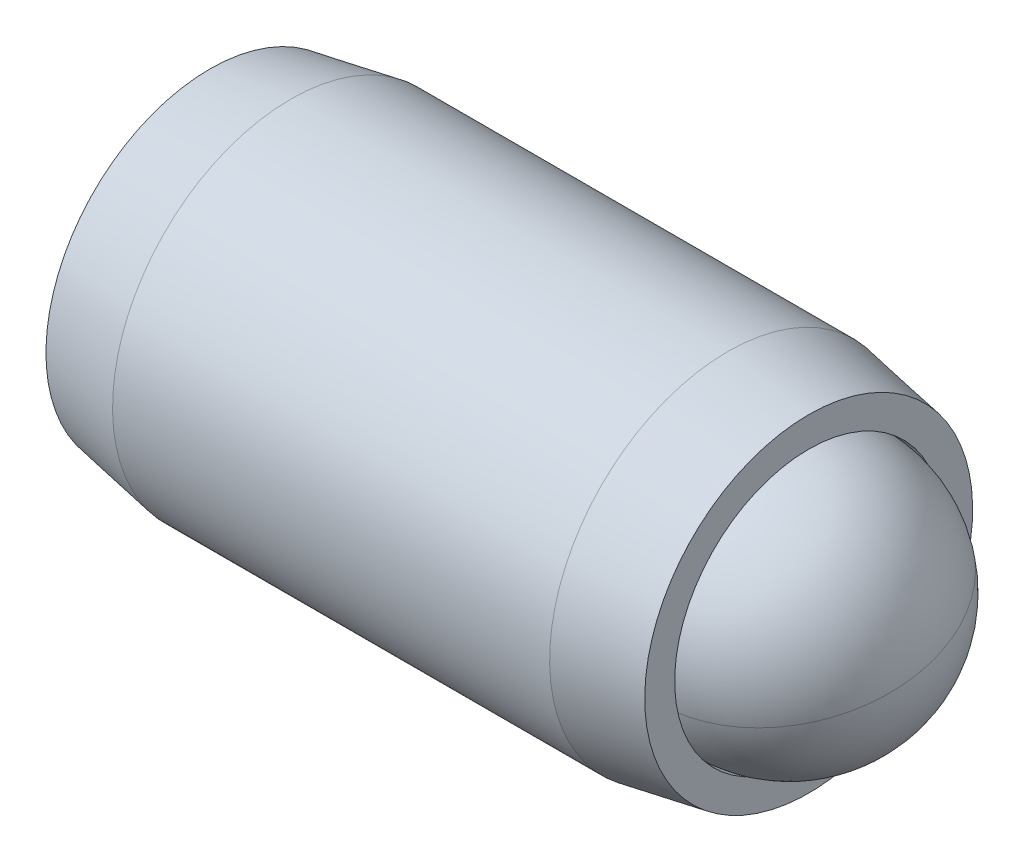
ISO-10303-21;
HEADER;
FILE_DESCRIPTION(('STEP AP214'),'2;1');
FILE_NAME('part.step','',(''),(''),'','','');
FILE_SCHEMA(('AUTOMOTIVE_DESIGN { 1 0 10303 214 1 1 1 1 }'));
ENDSEC;
DATA;
#1=APPLICATION_CONTEXT('core data for automotive mechanical design processes');
#2=APPLICATION_PROTOCOL_DEFINITION('international standard','automotive_design',2000,#1);
#3=PRODUCT_CONTEXT('',#1,'mechanical');
#4=PRODUCT('Part','Part','',(#3));
#5=PRODUCT_RELATED_PRODUCT_CATEGORY('part','',(#4));
#6=PRODUCT_DEFINITION_FORMATION('','',#4);
#7=PRODUCT_DEFINITION_CONTEXT('part definition',#1,'design');
#8=PRODUCT_DEFINITION('design','',#6,#7);
#9=PRODUCT_DEFINITION_SHAPE('','',#8);
#10=(LENGTH_UNIT() NAMED_UNIT(*) SI_UNIT(.MILLI.,.METRE.));
#11=(NAMED_UNIT(*) PLANE_ANGLE_UNIT() SI_UNIT($,.RADIAN.));
#12=(NAMED_UNIT(*) SI_UNIT($,.STERADIAN.) SOLID_ANGLE_UNIT());
#13=UNCERTAINTY_MEASURE_WITH_UNIT(LENGTH_MEASURE(1.E-05),#10,'distance_accuracy_value','');
#14=(GEOMETRIC_REPRESENTATION_CONTEXT(3) GLOBAL_UNCERTAINTY_ASSIGNED_CONTEXT((#13)) GLOBAL_UNIT_ASSIGNED_CONTEXT((#10,
#11,#12)) REPRESENTATION_CONTEXT('',''));
#15=CARTESIAN_POINT('',(0.,0.,0.));
#16=DIRECTION('',(0.,0.,1.));
#17=DIRECTION('',(1.,0.,0.));
#18=AXIS2_PLACEMENT_3D('',#15,#16,#17);
#19=CARTESIAN_POINT('',(-8.05134594701911,2.7420499882851,-0.965131231055238));
#20=DIRECTION('',(-1.,0.,0.));
#21=DIRECTION('',(0.,-1.,0.));
#22=AXIS2_PLACEMENT_3D('',#19,#20,#21);
#23=PLANE('',#22);
#24=DIRECTION('',(0.,0.866025403784439,-0.5));
#25=VECTOR('',#24,1.);
#26=CARTESIAN_POINT('',(-8.05134594701911,2.61504998828509,-2.33078112403965));
#27=LINE('',#26,#25);
#28=CARTESIAN_POINT('',(-8.05134594701911,1.49586248828509,-1.68461791964099));
#29=VERTEX_POINT('',#28);
#30=CARTESIAN_POINT('',(-8.05134594701911,2.74204998828509,-2.40410460822674));
#31=VERTEX_POINT('',#30);
#32=EDGE_CURVE('P0_E164',#29,#31,#27,.T.);
#33=ORIENTED_EDGE('',*,*,#32,.T.);
#34=DIRECTION('',(0.,0.866025403784439,0.5));
#35=VECTOR('',#34,1.);
#36=CARTESIAN_POINT('',(-8.05134594701911,3.8612374882851,-1.75794140382807));
#37=LINE('',#36,#35);
#38=CARTESIAN_POINT('',(-8.05134594701911,3.9882374882851,-1.68461791964099));
#39=VERTEX_POINT('',#38);
#40=EDGE_CURVE('P0_E166',#31,#39,#37,.T.);
#41=ORIENTED_EDGE('',*,*,#40,.T.);
#42=DIRECTION('',(0.,0.,1.));
#43=VECTOR('',#42,1.);
#44=CARTESIAN_POINT('',(-8.05134594701911,3.9882374882851,-0.392291510843657));
#45=LINE('',#44,#43);
#46=CARTESIAN_POINT('',(-8.05134594701911,3.9882374882851,-0.245644542469491));
#47=VERTEX_POINT('',#46);
#48=EDGE_CURVE('P0_E156',#39,#47,#45,.T.);
#49=ORIENTED_EDGE('',*,*,#48,.T.);
#50=DIRECTION('',(0.,-0.866025403784438,0.500000000000001));
#51=VECTOR('',#50,1.);
#52=CARTESIAN_POINT('',(-8.05134594701911,2.8690499882851,0.400518661929175));
#53=LINE('',#52,#51);
#54=CARTESIAN_POINT('',(-8.05134594701911,2.7420499882851,0.473842146116258));
#55=VERTEX_POINT('',#54);
#56=EDGE_CURVE('P0_E158',#47,#55,#53,.T.);
#57=ORIENTED_EDGE('',*,*,#56,.T.);
#58=DIRECTION('',(0.,-0.866025403784439,-0.5));
#59=VECTOR('',#58,1.);
#60=CARTESIAN_POINT('',(-8.05134594701911,1.62286248828509,-0.172321058282407));
#61=LINE('',#60,#59);
#62=CARTESIAN_POINT('',(-8.05134594701911,1.49586248828509,-0.24564454246949));
#63=VERTEX_POINT('',#62);
#64=EDGE_CURVE('P0_E160',#55,#63,#61,.T.);
#65=ORIENTED_EDGE('',*,*,#64,.T.);
#66=DIRECTION('',(0.,0.,-1.));
#67=VECTOR('',#66,1.);
#68=CARTESIAN_POINT('',(-8.05134594701911,1.49586248828509,-1.53797095126682));
#69=LINE('',#68,#67);
#70=EDGE_CURVE('P0_E162',#63,#29,#69,.T.);
#71=ORIENTED_EDGE('',*,*,#70,.T.);
#72=EDGE_LOOP('',(#33,#41,#49,#57,#65,#71));
#73=FACE_BOUND('',#72,.T.);
#74=CARTESIAN_POINT('',(-8.05134594701911,2.7420499882851,-0.965131231055238));
#75=DIRECTION('',(1.,0.,0.));
#76=DIRECTION('',(0.,1.,0.));
#77=AXIS2_PLACEMENT_3D('',#74,#75,#76);
#78=CIRCLE('',#77,2.921);
#79=CARTESIAN_POINT('',(-8.05134594701911,5.6630499882851,-0.965131231055238));
#80=VERTEX_POINT('',#79);
#81=EDGE_CURVE('P0_E150',#80,#80,#78,.T.);
#82=ORIENTED_EDGE('',*,*,#81,.F.);
#83=EDGE_LOOP('',(#82));
#84=FACE_BOUND('',#83,.T.);
#85=ADVANCED_FACE('P0_F17',(#73,#84),#23,.T.);
#86=CARTESIAN_POINT('',(-6.61084036483622,2.7420499882851,-0.965131231055238));
#87=DIRECTION('',(1.,0.,0.));
#88=DIRECTION('',(0.,1.,0.));
#89=AXIS2_PLACEMENT_3D('',#86,#87,#88);
#90=CONICAL_SURFACE('',#89,3.175,0.174532925199434);
#91=ORIENTED_EDGE('',*,*,#81,.T.);
#92=EDGE_LOOP('',(#91));
#93=FACE_BOUND('',#92,.T.);
#94=CARTESIAN_POINT('',(-6.61084036483622,2.7420499882851,-0.965131231055238));
#95=DIRECTION('',(1.,0.,0.));
#96=DIRECTION('',(0.,1.,0.));
#97=AXIS2_PLACEMENT_3D('',#94,#95,#96);
#98=CIRCLE('',#97,3.175);
#99=CARTESIAN_POINT('',(-6.61084036483622,5.9170499882851,-0.965131231055238));
#100=VERTEX_POINT('',#99);
#101=EDGE_CURVE('P0_E147',#100,#100,#98,.T.);
#102=ORIENTED_EDGE('',*,*,#101,.F.);
#103=EDGE_LOOP('',(#102));
#104=FACE_BOUND('',#103,.T.);
#105=ADVANCED_FACE('P0_F225',(#93,#104),#90,.T.);
#106=CARTESIAN_POINT('',(-1.10019199242004,2.7420499882851,-0.965131231055238));
#107=DIRECTION('',(1.,0.,0.));
#108=DIRECTION('',(0.,1.,0.));
#109=AXIS2_PLACEMENT_3D('',#106,#107,#108);
#110=CYLINDRICAL_SURFACE('',#109,3.175);
#111=ORIENTED_EDGE('',*,*,#101,.T.);
#112=EDGE_LOOP('',(#111));
#113=FACE_BOUND('',#112,.T.);
#114=CARTESIAN_POINT('',(1.176148470798,2.7420499882851,-0.965131231055238));
#115=DIRECTION('',(1.,0.,0.));
#116=DIRECTION('',(0.,1.,0.));
#117=AXIS2_PLACEMENT_3D('',#114,#115,#116);
#118=CIRCLE('',#117,3.175);
#119=CARTESIAN_POINT('',(1.176148470798,5.9170499882851,-0.965131231055238));
#120=VERTEX_POINT('',#119);
#121=EDGE_CURVE('P0_E144',#120,#120,#118,.T.);
#122=ORIENTED_EDGE('',*,*,#121,.F.);
#123=EDGE_LOOP('',(#122));
#124=FACE_BOUND('',#123,.T.);
#125=ADVANCED_FACE('P0_F231',(#113,#124),#110,.T.);
#126=CARTESIAN_POINT('',(2.61665405298089,2.7420499882851,-0.965131231055238));
#127=DIRECTION('',(-1.,0.,0.));
#128=DIRECTION('',(0.,-1.,0.));
#129=AXIS2_PLACEMENT_3D('',#126,#127,#128);
#130=CONICAL_SURFACE('',#129,2.921,0.174532925199434);
#131=ORIENTED_EDGE('',*,*,#121,.T.);
#132=EDGE_LOOP('',(#131));
#133=FACE_BOUND('',#132,.T.);
#134=CARTESIAN_POINT('',(2.61665405298089,2.7420499882851,-0.965131231055238));
#135=DIRECTION('',(1.,0.,0.));
#136=DIRECTION('',(0.,1.,0.));
#137=AXIS2_PLACEMENT_3D('',#134,#135,#136);
#138=CIRCLE('',#137,2.921);
#139=CARTESIAN_POINT('',(2.61665405298089,5.6630499882851,-0.965131231055238));
#140=VERTEX_POINT('',#139);
#141=EDGE_CURVE('P0_E141',#140,#140,#138,.T.);
#142=ORIENTED_EDGE('',*,*,#141,.F.);
#143=EDGE_LOOP('',(#142));
#144=FACE_BOUND('',#143,.T.);
#145=ADVANCED_FACE('P0_F275',(#133,#144),#130,.T.);
#146=CARTESIAN_POINT('',(2.61665405298089,5.6630499882851,-0.965131231055238));
#147=DIRECTION('',(1.,0.,0.));
#148=DIRECTION('',(0.,1.,0.));
#149=AXIS2_PLACEMENT_3D('',#146,#147,#148);
#150=PLANE('',#149);
#151=ORIENTED_EDGE('',*,*,#141,.T.);
#152=EDGE_LOOP('',(#151));
#153=FACE_BOUND('',#152,.T.);
#154=CARTESIAN_POINT('',(2.61665405298089,2.7420499882851,-0.965131231055238));
#155=DIRECTION('',(1.,0.,0.));
#156=DIRECTION('',(0.,1.,0.));
#157=AXIS2_PLACEMENT_3D('',#154,#155,#156);
#158=CIRCLE('',#157,2.3876);
#159=CARTESIAN_POINT('',(2.61665405298089,5.1296499882851,-0.965131231055238));
#160=VERTEX_POINT('',#159);
#161=EDGE_CURVE('P0_E138',#160,#160,#158,.T.);
#162=ORIENTED_EDGE('',*,*,#161,.F.);
#163=EDGE_LOOP('',(#162));
#164=FACE_BOUND('',#163,.T.);
#165=ADVANCED_FACE('P0_F271',(#153,#164),#150,.T.);
#166=CARTESIAN_POINT('',(-1.10019199242004,2.7420499882851,-0.965131231055238));
#167=DIRECTION('',(1.,0.,0.));
#168=DIRECTION('',(0.,1.,0.));
#169=AXIS2_PLACEMENT_3D('',#166,#167,#168);
#170=CYLINDRICAL_SURFACE('',#169,2.3876);
#171=ORIENTED_EDGE('',*,*,#161,.T.);
#172=EDGE_LOOP('',(#171));
#173=FACE_BOUND('',#172,.T.);
#174=CARTESIAN_POINT('',(1.28740800757995,2.7420499882851,-0.965131231055238));
#175=DIRECTION('',(1.,0.,0.));
#176=DIRECTION('',(0.,1.,0.));
#177=AXIS2_PLACEMENT_3D('',#174,#175,#176);
#178=CIRCLE('',#177,2.3876);
#179=CARTESIAN_POINT('',(1.28740800757995,5.1296499882851,-0.965131231055238));
#180=VERTEX_POINT('',#179);
#181=EDGE_CURVE('P0_E126',#180,#180,#178,.T.);
#182=ORIENTED_EDGE('',*,*,#181,.F.);
#183=EDGE_LOOP('',(#182));
#184=FACE_BOUND('',#183,.T.);
#185=ADVANCED_FACE('P0_F267',(#173,#184),#170,.F.);
#186=CARTESIAN_POINT('',(-1.10019199242004,2.7420499882851,-0.965131231055238));
#187=DIRECTION('',(1.,0.,0.));
#188=DIRECTION('',(0.,1.,0.));
#189=AXIS2_PLACEMENT_3D('',#186,#187,#188);
#190=CONICAL_SURFACE('',#189,0.,0.78539816339745);
#191=ORIENTED_EDGE('',*,*,#181,.T.);
#192=EDGE_LOOP('',(#191));
#193=FACE_BOUND('',#192,.T.);
#194=CARTESIAN_POINT('',(-1.10019199242004,2.7420499882851,-0.965131231055238));
#195=VERTEX_POINT('',#194);
#196=VERTEX_LOOP('',#195);
#197=FACE_BOUND('',#196,.T.);
#198=ADVANCED_FACE('P0_F221',(#193,#197),#190,.F.);
#199=CARTESIAN_POINT('',(-5.00334594701911,2.7420499882851,0.180548209367925));
#200=DIRECTION('',(0.,0.5,0.866025403784438));
#201=DIRECTION('',(0.,-0.866025403784438,0.500000000000001));
#202=AXIS2_PLACEMENT_3D('',#199,#200,#201);
#203=PLANE('',#202);
#204=DIRECTION('',(-1.,0.,0.));
#205=VECTOR('',#204,1.);
#206=CARTESIAN_POINT('',(-5.00334594701911,2.7420499882851,0.180548209367925));
#207=LINE('',#206,#205);
#208=CARTESIAN_POINT('',(-5.00334594701911,2.7420499882851,0.180548209367925));
#209=VERTEX_POINT('',#208);
#210=CARTESIAN_POINT('',(-7.79734594701911,2.7420499882851,0.180548209367925));
#211=VERTEX_POINT('',#210);
#212=EDGE_CURVE('P0_E124',#209,#211,#207,.T.);
#213=ORIENTED_EDGE('',*,*,#212,.T.);
#214=DIRECTION('',(0.,0.866025403784438,-0.500000000000001));
#215=VECTOR('',#214,1.);
#216=CARTESIAN_POINT('',(-7.79734594701911,3.73423748828509,-0.392291510843657));
#217=LINE('',#216,#215);
#218=CARTESIAN_POINT('',(-7.79734594701911,3.73423748828509,-0.392291510843657));
#219=VERTEX_POINT('',#218);
#220=EDGE_CURVE('P0_E26',#211,#219,#217,.T.);
#221=ORIENTED_EDGE('',*,*,#220,.T.);
#222=DIRECTION('',(-1.,0.,0.));
#223=VECTOR('',#222,1.);
#224=CARTESIAN_POINT('',(-5.00334594701911,3.7342374882851,-0.392291510843657));
#225=LINE('',#224,#223);
#226=CARTESIAN_POINT('',(-5.00334594701911,3.7342374882851,-0.392291510843657));
#227=VERTEX_POINT('',#226);
#228=EDGE_CURVE('P0_E90',#227,#219,#225,.T.);
#229=ORIENTED_EDGE('',*,*,#228,.F.);
#230=DIRECTION('',(0.,0.866025403784438,-0.5));
#231=VECTOR('',#230,1.);
#232=CARTESIAN_POINT('',(-5.00334594701911,2.7420499882851,0.180548209367925));
#233=LINE('',#232,#231);
#234=EDGE_CURVE('P0_E94',#209,#227,#233,.T.);
#235=ORIENTED_EDGE('',*,*,#234,.F.);
#236=EDGE_LOOP('',(#213,#221,#229,#235));
#237=FACE_BOUND('',#236,.T.);
#238=ADVANCED_FACE('P0_F92',(#237),#203,.F.);
#239=CARTESIAN_POINT('',(-5.00334594701911,1.74986248828509,-0.392291510843657));
#240=DIRECTION('',(0.,-0.5,0.866025403784439));
#241=DIRECTION('',(0.,-0.866025403784439,-0.5));
#242=AXIS2_PLACEMENT_3D('',#239,#240,#241);
#243=PLANE('',#242);
#244=DIRECTION('',(-1.,0.,0.));
#245=VECTOR('',#244,1.);
#246=CARTESIAN_POINT('',(-5.00334594701911,1.74986248828509,-0.392291510843657));
#247=LINE('',#246,#245);
#248=CARTESIAN_POINT('',(-5.00334594701911,1.74986248828509,-0.392291510843657));
#249=VERTEX_POINT('',#248);
#250=CARTESIAN_POINT('',(-7.79734594701911,1.74986248828509,-0.392291510843657));
#251=VERTEX_POINT('',#250);
#252=EDGE_CURVE('P0_E127',#249,#251,#247,.T.);
#253=ORIENTED_EDGE('',*,*,#252,.T.);
#254=DIRECTION('',(0.,0.866025403784439,0.5));
#255=VECTOR('',#254,1.);
#256=CARTESIAN_POINT('',(-7.79734594701911,2.7420499882851,0.180548209367925));
#257=LINE('',#256,#255);
#258=EDGE_CURVE('P0_E41',#251,#211,#257,.T.);
#259=ORIENTED_EDGE('',*,*,#258,.T.);
#260=ORIENTED_EDGE('',*,*,#212,.F.);
#261=DIRECTION('',(0.,0.866025403784439,0.5));
#262=VECTOR('',#261,1.);
#263=CARTESIAN_POINT('',(-5.00334594701911,1.74986248828509,-0.392291510843657));
#264=LINE('',#263,#262);
#265=EDGE_CURVE('P0_E99',#249,#209,#264,.T.);
#266=ORIENTED_EDGE('',*,*,#265,.F.);
#267=EDGE_LOOP('',(#253,#259,#260,#266));
#268=FACE_BOUND('',#267,.T.);
#269=ADVANCED_FACE('P0_F212',(#268),#243,.F.);
#270=CARTESIAN_POINT('',(-5.00334594701911,1.74986248828509,-1.53797095126682));
#271=DIRECTION('',(0.,-1.,0.));
#272=DIRECTION('',(0.,0.,-1.));
#273=AXIS2_PLACEMENT_3D('',#270,#271,#272);
#274=PLANE('',#273);
#275=DIRECTION('',(-1.,0.,0.));
#276=VECTOR('',#275,1.);
#277=CARTESIAN_POINT('',(-5.00334594701911,1.74986248828509,-1.53797095126682));
#278=LINE('',#277,#276);
#279=CARTESIAN_POINT('',(-5.00334594701911,1.74986248828509,-1.53797095126682));
#280=VERTEX_POINT('',#279);
#281=CARTESIAN_POINT('',(-7.79734594701911,1.74986248828509,-1.53797095126682));
#282=VERTEX_POINT('',#281);
#283=EDGE_CURVE('P0_E129',#280,#282,#278,.T.);
#284=ORIENTED_EDGE('',*,*,#283,.T.);
#285=DIRECTION('',(0.,0.,1.));
#286=VECTOR('',#285,1.);
#287=CARTESIAN_POINT('',(-7.79734594701911,1.74986248828509,-0.392291510843657));
#288=LINE('',#287,#286);
#289=EDGE_CURVE('P0_E171',#282,#251,#288,.T.);
#290=ORIENTED_EDGE('',*,*,#289,.T.);
#291=ORIENTED_EDGE('',*,*,#252,.F.);
#292=DIRECTION('',(0.,0.,1.));
#293=VECTOR('',#292,1.);
#294=CARTESIAN_POINT('',(-5.00334594701911,1.74986248828509,-1.53797095126682));
#295=LINE('',#294,#293);
#296=EDGE_CURVE('P0_E121',#280,#249,#295,.T.);
#297=ORIENTED_EDGE('',*,*,#296,.F.);
#298=EDGE_LOOP('',(#284,#290,#291,#297));
#299=FACE_BOUND('',#298,.T.);
#300=ADVANCED_FACE('P0_F211',(#299),#274,.F.);
#301=CARTESIAN_POINT('',(-5.00334594701911,2.74204998828509,-2.1108106714784));
#302=DIRECTION('',(0.,-0.5,-0.866025403784438));
#303=DIRECTION('',(0.,0.866025403784439,-0.5));
#304=AXIS2_PLACEMENT_3D('',#301,#302,#303);
#305=PLANE('',#304);
#306=DIRECTION('',(-1.,0.,0.));
#307=VECTOR('',#306,1.);
#308=CARTESIAN_POINT('',(-5.00334594701911,2.74204998828509,-2.1108106714784));
#309=LINE('',#308,#307);
#310=CARTESIAN_POINT('',(-5.00334594701911,2.74204998828509,-2.1108106714784));
#311=VERTEX_POINT('',#310);
#312=CARTESIAN_POINT('',(-7.79734594701911,2.74204998828509,-2.1108106714784));
#313=VERTEX_POINT('',#312);
#314=EDGE_CURVE('P0_E132',#311,#313,#309,.T.);
#315=ORIENTED_EDGE('',*,*,#314,.T.);
#316=DIRECTION('',(0.,-0.866025403784439,0.5));
#317=VECTOR('',#316,1.);
#318=CARTESIAN_POINT('',(-7.79734594701911,1.74986248828509,-1.53797095126682));
#319=LINE('',#318,#317);
#320=EDGE_CURVE('P0_E169',#313,#282,#319,.T.);
#321=ORIENTED_EDGE('',*,*,#320,.T.);
#322=ORIENTED_EDGE('',*,*,#283,.F.);
#323=DIRECTION('',(0.,-0.866025403784438,0.5));
#324=VECTOR('',#323,1.);
#325=CARTESIAN_POINT('',(-5.00334594701911,2.74204998828509,-2.1108106714784));
#326=LINE('',#325,#324);
#327=EDGE_CURVE('P0_E118',#311,#280,#326,.T.);
#328=ORIENTED_EDGE('',*,*,#327,.F.);
#329=EDGE_LOOP('',(#315,#321,#322,#328));
#330=FACE_BOUND('',#329,.T.);
#331=ADVANCED_FACE('P0_F208',(#330),#305,.F.);
#332=CARTESIAN_POINT('',(-5.00334594701911,3.7342374882851,-1.53797095126682));
#333=DIRECTION('',(0.,0.5,-0.866025403784439));
#334=DIRECTION('',(0.,0.866025403784439,0.5));
#335=AXIS2_PLACEMENT_3D('',#332,#333,#334);
#336=PLANE('',#335);
#337=DIRECTION('',(-1.,0.,0.));
#338=VECTOR('',#337,1.);
#339=CARTESIAN_POINT('',(-5.00334594701911,3.7342374882851,-1.53797095126682));
#340=LINE('',#339,#338);
#341=CARTESIAN_POINT('',(-5.00334594701911,3.7342374882851,-1.53797095126682));
#342=VERTEX_POINT('',#341);
#343=CARTESIAN_POINT('',(-7.79734594701911,3.73423748828509,-1.53797095126682));
#344=VERTEX_POINT('',#343);
#345=EDGE_CURVE('P0_E98',#342,#344,#340,.T.);
#346=ORIENTED_EDGE('',*,*,#345,.T.);
#347=DIRECTION('',(0.,-0.866025403784439,-0.5));
#348=VECTOR('',#347,1.);
#349=CARTESIAN_POINT('',(-7.79734594701911,2.74204998828509,-2.1108106714784));
#350=LINE('',#349,#348);
#351=EDGE_CURVE('P0_E153',#344,#313,#350,.T.);
#352=ORIENTED_EDGE('',*,*,#351,.T.);
#353=ORIENTED_EDGE('',*,*,#314,.F.);
#354=DIRECTION('',(0.,-0.866025403784439,-0.5));
#355=VECTOR('',#354,1.);
#356=CARTESIAN_POINT('',(-5.00334594701911,3.7342374882851,-1.53797095126682));
#357=LINE('',#356,#355);
#358=EDGE_CURVE('P0_E108',#342,#311,#357,.T.);
#359=ORIENTED_EDGE('',*,*,#358,.F.);
#360=EDGE_LOOP('',(#346,#352,#353,#359));
#361=FACE_BOUND('',#360,.T.);
#362=ADVANCED_FACE('P0_F204',(#361),#336,.F.);
#363=CARTESIAN_POINT('',(-5.00334594701911,3.7342374882851,-0.392291510843657));
#364=DIRECTION('',(0.,1.,0.));
#365=DIRECTION('',(-1.,0.,0.));
#366=AXIS2_PLACEMENT_3D('',#363,#364,#365);
#367=PLANE('',#366);
#368=ORIENTED_EDGE('',*,*,#228,.T.);
#369=DIRECTION('',(0.,0.,-1.));
#370=VECTOR('',#369,1.);
#371=CARTESIAN_POINT('',(-7.79734594701911,3.73423748828509,-1.53797095126682));
#372=LINE('',#371,#370);
#373=EDGE_CURVE('P0_E11',#219,#344,#372,.T.);
#374=ORIENTED_EDGE('',*,*,#373,.T.);
#375=ORIENTED_EDGE('',*,*,#345,.F.);
#376=DIRECTION('',(0.,0.,-1.));
#377=VECTOR('',#376,1.);
#378=CARTESIAN_POINT('',(-5.00334594701911,3.7342374882851,-0.392291510843657));
#379=LINE('',#378,#377);
#380=EDGE_CURVE('P0_E102',#227,#342,#379,.T.);
#381=ORIENTED_EDGE('',*,*,#380,.F.);
#382=EDGE_LOOP('',(#368,#374,#375,#381));
#383=FACE_BOUND('',#382,.T.);
#384=ADVANCED_FACE('P0_F103',(#383),#367,.F.);
#385=CARTESIAN_POINT('',(-5.00334594701911,4.7264249882851,-0.965131231055239));
#386=DIRECTION('',(-1.,0.,0.));
#387=DIRECTION('',(0.,0.,1.));
#388=AXIS2_PLACEMENT_3D('',#385,#386,#387);
#389=PLANE('',#388);
#390=ORIENTED_EDGE('',*,*,#234,.T.);
#391=ORIENTED_EDGE('',*,*,#380,.T.);
#392=ORIENTED_EDGE('',*,*,#358,.T.);
#393=ORIENTED_EDGE('',*,*,#327,.T.);
#394=ORIENTED_EDGE('',*,*,#296,.T.);
#395=ORIENTED_EDGE('',*,*,#265,.T.);
#396=EDGE_LOOP('',(#390,#391,#392,#393,#394,#395));
#397=FACE_BOUND('',#396,.T.);
#398=ADVANCED_FACE('P0_F110',(#397),#389,.T.);
#399=CARTESIAN_POINT('',(-7.79734594701911,1.74986248828509,-0.392291510843657));
#400=DIRECTION('',(-0.70710678118655,0.353553390593272,-0.612372435695792));
#401=DIRECTION('',(-0.654653670707974,0.,0.755928946018457));
#402=AXIS2_PLACEMENT_3D('',#399,#400,#401);
#403=PLANE('',#402);
#404=DIRECTION('',(-0.654653670707975,-0.654653670707979,0.377964473009229));
#405=VECTOR('',#404,1.);
#406=CARTESIAN_POINT('',(-7.51386380416196,2.03334463114224,-0.555960002332682));
#407=LINE('',#406,#405);
#408=EDGE_CURVE('P0_E115',#63,#251,#407,.F.);
#409=ORIENTED_EDGE('',*,*,#408,.F.);
#410=ORIENTED_EDGE('',*,*,#64,.F.);
#411=DIRECTION('',(-0.654653670707974,0.,0.755928946018457));
#412=VECTOR('',#411,1.);
#413=CARTESIAN_POINT('',(-7.51386380416197,2.7420499882851,-0.146788773610124));
#414=LINE('',#413,#412);
#415=EDGE_CURVE('P0_E21',#211,#55,#414,.T.);
#416=ORIENTED_EDGE('',*,*,#415,.F.);
#417=ORIENTED_EDGE('',*,*,#258,.F.);
#418=EDGE_LOOP('',(#409,#410,#416,#417));
#419=FACE_BOUND('',#418,.T.);
#420=ADVANCED_FACE('P0_F19',(#419),#403,.T.);
#421=CARTESIAN_POINT('',(-7.79734594701911,2.7420499882851,0.180548209367925));
#422=DIRECTION('',(-0.70710678118655,-0.353553390593273,-0.612372435695792));
#423=DIRECTION('',(-0.654653670707975,0.,0.755928946018457));
#424=AXIS2_PLACEMENT_3D('',#421,#422,#423);
#425=PLANE('',#424);
#426=ORIENTED_EDGE('',*,*,#415,.T.);
#427=ORIENTED_EDGE('',*,*,#56,.F.);
#428=DIRECTION('',(-0.654653670707975,0.654653670707979,0.377964473009228));
#429=VECTOR('',#428,1.);
#430=CARTESIAN_POINT('',(-7.51386380416197,3.45075534542795,-0.555960002332681));
#431=LINE('',#430,#429);
#432=EDGE_CURVE('P0_E182',#219,#47,#431,.T.);
#433=ORIENTED_EDGE('',*,*,#432,.F.);
#434=ORIENTED_EDGE('',*,*,#220,.F.);
#435=EDGE_LOOP('',(#426,#427,#433,#434));
#436=FACE_BOUND('',#435,.T.);
#437=ADVANCED_FACE('P0_F196',(#436),#425,.T.);
#438=CARTESIAN_POINT('',(-7.79734594701911,1.74986248828509,-1.53797095126682));
#439=DIRECTION('',(-0.70710678118655,0.707106781186545,0.));
#440=DIRECTION('',(-0.707106781186545,-0.70710678118655,0.));
#441=AXIS2_PLACEMENT_3D('',#438,#439,#440);
#442=PLANE('',#441);
#443=ORIENTED_EDGE('',*,*,#408,.T.);
#444=ORIENTED_EDGE('',*,*,#289,.F.);
#445=DIRECTION('',(-0.654653670707975,-0.654653670707979,-0.377964473009228));
#446=VECTOR('',#445,1.);
#447=CARTESIAN_POINT('',(-7.51386380416197,2.03334463114224,-1.3743024597778));
#448=LINE('',#447,#446);
#449=EDGE_CURVE('P0_E179',#29,#282,#448,.F.);
#450=ORIENTED_EDGE('',*,*,#449,.F.);
#451=ORIENTED_EDGE('',*,*,#70,.F.);
#452=EDGE_LOOP('',(#443,#444,#450,#451));
#453=FACE_BOUND('',#452,.T.);
#454=ADVANCED_FACE('P0_F189',(#453),#442,.T.);
#455=CARTESIAN_POINT('',(-7.79734594701911,3.73423748828509,-0.392291510843657));
#456=DIRECTION('',(-0.70710678118655,-0.707106781186545,0.));
#457=DIRECTION('',(0.707106781186545,-0.70710678118655,0.));
#458=AXIS2_PLACEMENT_3D('',#455,#456,#457);
#459=PLANE('',#458);
#460=ORIENTED_EDGE('',*,*,#432,.T.);
#461=ORIENTED_EDGE('',*,*,#48,.F.);
#462=DIRECTION('',(0.654653670707974,-0.654653670707979,0.377964473009229));
#463=VECTOR('',#462,1.);
#464=CARTESIAN_POINT('',(-7.79734594701911,3.73423748828509,-1.53797095126682));
#465=LINE('',#464,#463);
#466=EDGE_CURVE('P0_E177',#344,#39,#465,.F.);
#467=ORIENTED_EDGE('',*,*,#466,.F.);
#468=ORIENTED_EDGE('',*,*,#373,.F.);
#469=EDGE_LOOP('',(#460,#461,#467,#468));
#470=FACE_BOUND('',#469,.T.);
#471=ADVANCED_FACE('P0_F201',(#470),#459,.T.);
#472=CARTESIAN_POINT('',(-7.79734594701911,2.74204998828509,-2.1108106714784));
#473=DIRECTION('',(-0.70710678118655,0.353553390593273,0.612372435695793));
#474=DIRECTION('',(0.654653670707975,0.,0.755928946018457));
#475=AXIS2_PLACEMENT_3D('',#472,#473,#474);
#476=PLANE('',#475);
#477=ORIENTED_EDGE('',*,*,#449,.T.);
#478=ORIENTED_EDGE('',*,*,#320,.F.);
#479=DIRECTION('',(-0.654653670707975,0.,-0.755928946018457));
#480=VECTOR('',#479,1.);
#481=CARTESIAN_POINT('',(-7.51386380416197,2.74204998828509,-1.78347368850035));
#482=LINE('',#481,#480);
#483=EDGE_CURVE('P0_E175',#31,#313,#482,.F.);
#484=ORIENTED_EDGE('',*,*,#483,.F.);
#485=ORIENTED_EDGE('',*,*,#32,.F.);
#486=EDGE_LOOP('',(#477,#478,#484,#485));
#487=FACE_BOUND('',#486,.T.);
#488=ADVANCED_FACE('P0_F240',(#487),#476,.T.);
#489=CARTESIAN_POINT('',(-7.79734594701911,3.73423748828509,-1.53797095126682));
#490=DIRECTION('',(-0.70710678118655,-0.353553390593272,0.612372435695792));
#491=DIRECTION('',(0.654653670707975,0.,0.755928946018457));
#492=AXIS2_PLACEMENT_3D('',#489,#490,#491);
#493=PLANE('',#492);
#494=ORIENTED_EDGE('',*,*,#466,.T.);
#495=ORIENTED_EDGE('',*,*,#40,.F.);
#496=ORIENTED_EDGE('',*,*,#483,.T.);
#497=ORIENTED_EDGE('',*,*,#351,.F.);
#498=EDGE_LOOP('',(#494,#495,#496,#497));
#499=FACE_BOUND('',#498,.T.);
#500=ADVANCED_FACE('P0_F237',(#499),#493,.T.);
#501=CLOSED_SHELL('',(#85,#105,#125,#145,#165,#185,#198,#238,#269,#300,#331,#362,#384,#398,#420,
#437,#454,#471,#488,#500));
#502=MANIFOLD_SOLID_BREP('P0_B1',#501);
#503=CARTESIAN_POINT('',(2.26740405298089,2.7420499882851,-0.965131231055239));
#504=DIRECTION('',(0.,0.972214232741158,0.234092899626454));
#505=DIRECTION('',(0.,0.234092899626454,-0.972214232741158));
#506=AXIS2_PLACEMENT_3D('',#503,#504,#505);
#507=SPHERICAL_SURFACE('',#506,2.38125);
#508=CARTESIAN_POINT('',(2.26740405298089,2.7420499882851,-0.965131231055239));
#509=DIRECTION('',(1.,0.,0.));
#510=DIRECTION('',(0.,0.234092899626454,-0.972214232741158));
#511=AXIS2_PLACEMENT_3D('',#508,#509,#510);
#512=CIRCLE('',#511,2.38125);
#513=CARTESIAN_POINT('',(2.26740405298089,3.29948370552059,-3.28021637277012));
#514=VERTEX_POINT('',#513);
#515=CARTESIAN_POINT('',(2.26740405298089,2.1846162710496,1.34995391065964));
#516=VERTEX_POINT('',#515);
#517=EDGE_CURVE('P1_E33',#514,#516,#512,.T.);
#518=ORIENTED_EDGE('',*,*,#517,.T.);
#519=CARTESIAN_POINT('',(2.26740405298089,2.7420499882851,-0.965131231055239));
#520=DIRECTION('',(0.,0.972214232741158,0.234092899626454));
#521=DIRECTION('',(1.,0.,0.));
#522=AXIS2_PLACEMENT_3D('',#519,#520,#521);
#523=CIRCLE('',#522,2.38125);
#524=EDGE_CURVE('P1_E10',#516,#514,#523,.T.);
#525=ORIENTED_EDGE('',*,*,#524,.T.);
#526=EDGE_LOOP('',(#518,#525));
#527=FACE_BOUND('',#526,.T.);
#528=ADVANCED_FACE('P1_F16',(#527),#507,.T.);
#529=ORIENTED_EDGE('',*,*,#517,.F.);
#530=CARTESIAN_POINT('',(2.26740405298089,2.7420499882851,-0.965131231055239));
#531=DIRECTION('',(0.,0.972214232741158,0.234092899626454));
#532=DIRECTION('',(1.,0.,0.));
#533=AXIS2_PLACEMENT_3D('',#530,#531,#532);
#534=CIRCLE('',#533,2.38125);
#535=EDGE_CURVE('P1_E23',#514,#516,#534,.T.);
#536=ORIENTED_EDGE('',*,*,#535,.T.);
#537=EDGE_LOOP('',(#529,#536));
#538=FACE_BOUND('',#537,.T.);
#539=ADVANCED_FACE('P1_F40',(#538),#507,.T.);
#540=ORIENTED_EDGE('',*,*,#524,.F.);
#541=EDGE_CURVE('P1_E36',#516,#514,#512,.T.);
#542=ORIENTED_EDGE('',*,*,#541,.T.);
#543=EDGE_LOOP('',(#540,#542));
#544=FACE_BOUND('',#543,.T.);
#545=ADVANCED_FACE('P1_F38',(#544),#507,.T.);
#546=ORIENTED_EDGE('',*,*,#535,.F.);
#547=ORIENTED_EDGE('',*,*,#541,.F.);
#548=EDGE_LOOP('',(#546,#547));
#549=FACE_BOUND('',#548,.T.);
#550=ADVANCED_FACE('P1_F18',(#549),#507,.T.);
#551=CLOSED_SHELL('',(#528,#539,#545,#550));
#552=MANIFOLD_SOLID_BREP('P1_B1',#551);
#553=ADVANCED_BREP_SHAPE_REPRESENTATION('',(#18,#502,#552),#14);
#554=SHAPE_DEFINITION_REPRESENTATION(#9,#553);
ENDSEC;
END-ISO-10303-21;
